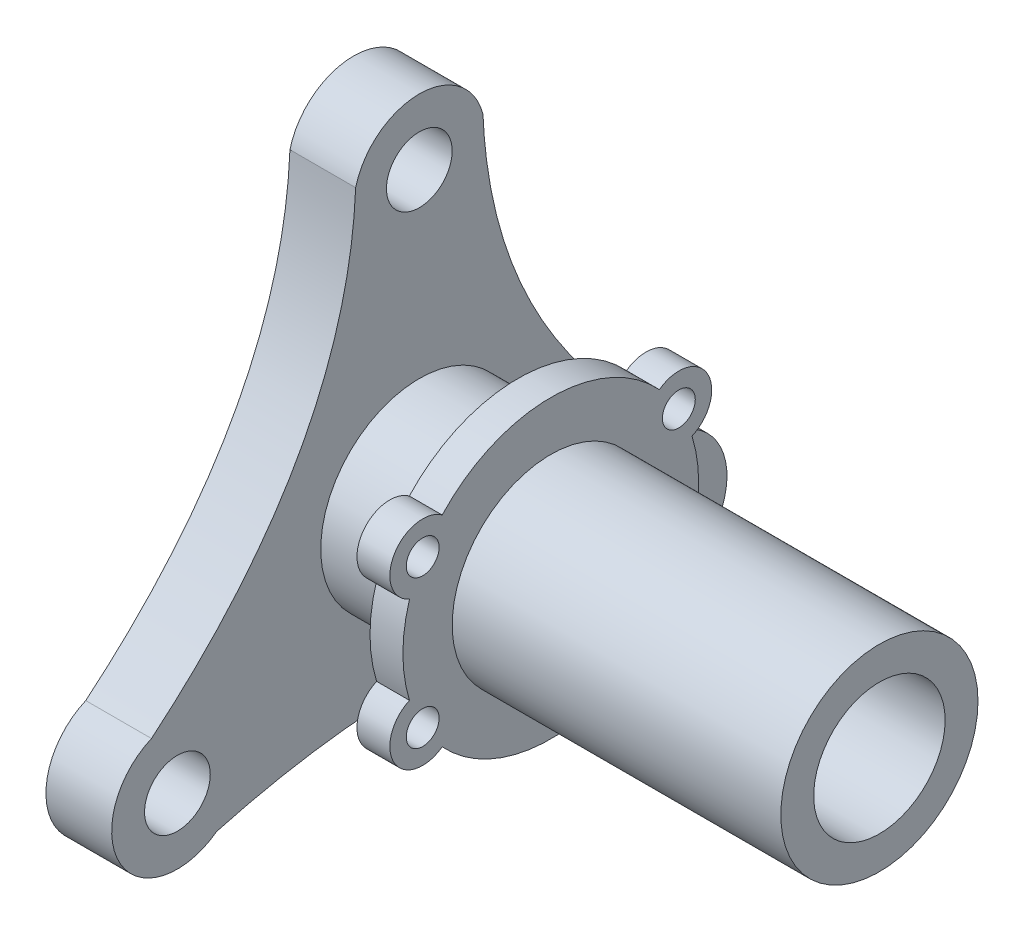
ISO-10303-21;
HEADER;
FILE_DESCRIPTION(('STEP AP214'),'2;1');
FILE_NAME('part.step','',(''),(''),'','','');
FILE_SCHEMA(('AUTOMOTIVE_DESIGN { 1 0 10303 214 1 1 1 1 }'));
ENDSEC;
DATA;
#1=APPLICATION_CONTEXT('core data for automotive mechanical design processes');
#2=APPLICATION_PROTOCOL_DEFINITION('international standard','automotive_design',2000,#1);
#3=PRODUCT_CONTEXT('',#1,'mechanical');
#4=PRODUCT('Part','Part','',(#3));
#5=PRODUCT_RELATED_PRODUCT_CATEGORY('part','',(#4));
#6=PRODUCT_DEFINITION_FORMATION('','',#4);
#7=PRODUCT_DEFINITION_CONTEXT('part definition',#1,'design');
#8=PRODUCT_DEFINITION('design','',#6,#7);
#9=PRODUCT_DEFINITION_SHAPE('','',#8);
#10=(LENGTH_UNIT() NAMED_UNIT(*) SI_UNIT(.MILLI.,.METRE.));
#11=(NAMED_UNIT(*) PLANE_ANGLE_UNIT() SI_UNIT($,.RADIAN.));
#12=(NAMED_UNIT(*) SI_UNIT($,.STERADIAN.) SOLID_ANGLE_UNIT());
#13=UNCERTAINTY_MEASURE_WITH_UNIT(LENGTH_MEASURE(1.E-05),#10,'distance_accuracy_value','');
#14=(GEOMETRIC_REPRESENTATION_CONTEXT(3) GLOBAL_UNCERTAINTY_ASSIGNED_CONTEXT((#13)) GLOBAL_UNIT_ASSIGNED_CONTEXT((#10,
#11,#12)) REPRESENTATION_CONTEXT('',''));
#15=CARTESIAN_POINT('',(0.,0.,0.));
#16=DIRECTION('',(0.,0.,1.));
#17=DIRECTION('',(1.,0.,0.));
#18=AXIS2_PLACEMENT_3D('',#15,#16,#17);
#19=CARTESIAN_POINT('',(30.,0.,0.));
#20=DIRECTION('',(1.,0.,0.));
#21=DIRECTION('',(0.,0.,-1.));
#22=AXIS2_PLACEMENT_3D('',#19,#20,#21);
#23=PLANE('',#22);
#24=CARTESIAN_POINT('',(30.,0.,0.));
#25=DIRECTION('',(1.,0.,0.));
#26=DIRECTION('',(0.,0.,-1.));
#27=AXIS2_PLACEMENT_3D('',#24,#25,#26);
#28=CIRCLE('',#27,22.5);
#29=CARTESIAN_POINT('',(30.,6.66890739310312,21.4889663358249));
#30=VERTEX_POINT('',#29);
#31=CARTESIAN_POINT('',(30.,-6.66890739310267,21.488966335825));
#32=VERTEX_POINT('',#31);
#33=EDGE_CURVE('E233',#30,#32,#28,.T.);
#34=ORIENTED_EDGE('',*,*,#33,.T.);
#35=CARTESIAN_POINT('',(30.,-11.2499999999998,19.48557158515));
#36=DIRECTION('',(1.,0.,0.));
#37=DIRECTION('',(0.,0.,-1.));
#38=AXIS2_PLACEMENT_3D('',#35,#36,#37);
#39=CIRCLE('',#38,5.);
#40=CARTESIAN_POINT('',(30.,-15.2755370513414,16.5199263858256));
#41=VERTEX_POINT('',#40);
#42=EDGE_CURVE('E230',#32,#41,#39,.T.);
#43=ORIENTED_EDGE('',*,*,#42,.T.);
#44=CARTESIAN_POINT('',(30.,0.,0.));
#45=DIRECTION('',(1.,0.,0.));
#46=DIRECTION('',(0.,0.,-1.));
#47=AXIS2_PLACEMENT_3D('',#44,#45,#46);
#48=CIRCLE('',#47,22.5);
#49=CARTESIAN_POINT('',(30.,-15.2755370513417,-16.5199263858253));
#50=VERTEX_POINT('',#49);
#51=EDGE_CURVE('E227',#41,#50,#48,.T.);
#52=ORIENTED_EDGE('',*,*,#51,.T.);
#53=CARTESIAN_POINT('',(30.,-11.2500000000001,-19.4855715851498));
#54=DIRECTION('',(1.,0.,0.));
#55=DIRECTION('',(0.,0.,-1.));
#56=AXIS2_PLACEMENT_3D('',#53,#54,#55);
#57=CIRCLE('',#56,5.00000000000002);
#58=CARTESIAN_POINT('',(30.,-6.66890739310296,-21.4889663358249));
#59=VERTEX_POINT('',#58);
#60=EDGE_CURVE('E224',#50,#59,#57,.T.);
#61=ORIENTED_EDGE('',*,*,#60,.T.);
#62=CARTESIAN_POINT('',(30.,0.,0.));
#63=DIRECTION('',(1.,0.,0.));
#64=DIRECTION('',(0.,0.,-1.));
#65=AXIS2_PLACEMENT_3D('',#62,#63,#64);
#66=CIRCLE('',#65,22.5);
#67=CARTESIAN_POINT('',(30.,6.66890739310282,-21.488966335825));
#68=VERTEX_POINT('',#67);
#69=EDGE_CURVE('E221',#59,#68,#66,.T.);
#70=ORIENTED_EDGE('',*,*,#69,.T.);
#71=CARTESIAN_POINT('',(30.,11.25,-19.4855715851499));
#72=DIRECTION('',(1.,0.,0.));
#73=DIRECTION('',(0.,0.,-1.));
#74=AXIS2_PLACEMENT_3D('',#71,#72,#73);
#75=CIRCLE('',#74,5.);
#76=CARTESIAN_POINT('',(30.,15.2755370513415,-16.5199263858255));
#77=VERTEX_POINT('',#76);
#78=EDGE_CURVE('E218',#68,#77,#75,.T.);
#79=ORIENTED_EDGE('',*,*,#78,.T.);
#80=CARTESIAN_POINT('',(30.,0.,0.));
#81=DIRECTION('',(1.,0.,0.));
#82=DIRECTION('',(0.,0.,-1.));
#83=AXIS2_PLACEMENT_3D('',#80,#81,#82);
#84=CIRCLE('',#83,22.5);
#85=CARTESIAN_POINT('',(30.,15.2755370513418,16.5199263858252));
#86=VERTEX_POINT('',#85);
#87=EDGE_CURVE('E215',#77,#86,#84,.T.);
#88=ORIENTED_EDGE('',*,*,#87,.T.);
#89=CARTESIAN_POINT('',(30.,11.2500000000002,19.4855715851497));
#90=DIRECTION('',(1.,0.,0.));
#91=DIRECTION('',(0.,0.,-1.));
#92=AXIS2_PLACEMENT_3D('',#89,#90,#91);
#93=CIRCLE('',#92,5.);
#94=EDGE_CURVE('E211',#86,#30,#93,.T.);
#95=ORIENTED_EDGE('',*,*,#94,.T.);
#96=EDGE_LOOP('',(#34,#43,#52,#61,#70,#79,#88,#95));
#97=FACE_BOUND('',#96,.T.);
#98=CARTESIAN_POINT('',(30.,11.25,-19.4855715851499));
#99=DIRECTION('',(1.,0.,0.));
#100=DIRECTION('',(0.,0.,-1.));
#101=AXIS2_PLACEMENT_3D('',#98,#99,#100);
#102=CIRCLE('',#101,2.5);
#103=CARTESIAN_POINT('',(30.,11.25,-21.9855715851499));
#104=VERTEX_POINT('',#103);
#105=EDGE_CURVE('E259',#104,#104,#102,.T.);
#106=ORIENTED_EDGE('',*,*,#105,.F.);
#107=EDGE_LOOP('',(#106));
#108=FACE_BOUND('',#107,.T.);
#109=CARTESIAN_POINT('',(30.,-11.2500000000001,-19.4855715851498));
#110=DIRECTION('',(1.,0.,0.));
#111=DIRECTION('',(0.,0.,-1.));
#112=AXIS2_PLACEMENT_3D('',#109,#110,#111);
#113=CIRCLE('',#112,2.5);
#114=CARTESIAN_POINT('',(30.,-11.2500000000001,-21.9855715851498));
#115=VERTEX_POINT('',#114);
#116=EDGE_CURVE('E265',#115,#115,#113,.T.);
#117=ORIENTED_EDGE('',*,*,#116,.F.);
#118=EDGE_LOOP('',(#117));
#119=FACE_BOUND('',#118,.T.);
#120=CARTESIAN_POINT('',(30.,-11.2499999999998,19.48557158515));
#121=DIRECTION('',(1.,0.,0.));
#122=DIRECTION('',(0.,0.,-1.));
#123=AXIS2_PLACEMENT_3D('',#120,#121,#122);
#124=CIRCLE('',#123,2.5);
#125=CARTESIAN_POINT('',(30.,-11.2499999999998,16.98557158515));
#126=VERTEX_POINT('',#125);
#127=EDGE_CURVE('E271',#126,#126,#124,.T.);
#128=ORIENTED_EDGE('',*,*,#127,.F.);
#129=EDGE_LOOP('',(#128));
#130=FACE_BOUND('',#129,.T.);
#131=CARTESIAN_POINT('',(30.,11.2500000000002,19.4855715851497));
#132=DIRECTION('',(1.,0.,0.));
#133=DIRECTION('',(0.,0.,-1.));
#134=AXIS2_PLACEMENT_3D('',#131,#132,#133);
#135=CIRCLE('',#134,2.5);
#136=CARTESIAN_POINT('',(30.,11.2500000000002,16.9855715851497));
#137=VERTEX_POINT('',#136);
#138=EDGE_CURVE('E277',#137,#137,#135,.T.);
#139=ORIENTED_EDGE('',*,*,#138,.F.);
#140=EDGE_LOOP('',(#139));
#141=FACE_BOUND('',#140,.T.);
#142=CARTESIAN_POINT('',(30.,0.,0.));
#143=DIRECTION('',(1.,0.,0.));
#144=DIRECTION('',(0.,0.,-1.));
#145=AXIS2_PLACEMENT_3D('',#142,#143,#144);
#146=CIRCLE('',#145,15.);
#147=CARTESIAN_POINT('',(30.,0.,-15.));
#148=VERTEX_POINT('',#147);
#149=EDGE_CURVE('E283',#148,#148,#146,.T.);
#150=ORIENTED_EDGE('',*,*,#149,.F.);
#151=EDGE_LOOP('',(#150));
#152=FACE_BOUND('',#151,.T.);
#153=ADVANCED_FACE('F36',(#97,#108,#119,#130,#141,#152),#23,.T.);
#154=CARTESIAN_POINT('',(30.,0.,0.));
#155=DIRECTION('',(-1.,0.,0.));
#156=DIRECTION('',(0.,0.,1.));
#157=AXIS2_PLACEMENT_3D('',#154,#155,#156);
#158=CYLINDRICAL_SURFACE('',#157,15.);
#159=CARTESIAN_POINT('',(10.,0.,0.));
#160=DIRECTION('',(1.,0.,0.));
#161=DIRECTION('',(0.,0.,-1.));
#162=AXIS2_PLACEMENT_3D('',#159,#160,#161);
#163=CIRCLE('',#162,15.);
#164=CARTESIAN_POINT('',(10.,0.,-15.));
#165=VERTEX_POINT('',#164);
#166=EDGE_CURVE('E181',#165,#165,#163,.T.);
#167=ORIENTED_EDGE('',*,*,#166,.T.);
#168=EDGE_LOOP('',(#167));
#169=FACE_BOUND('',#168,.T.);
#170=CARTESIAN_POINT('',(25.,0.,0.));
#171=DIRECTION('',(1.,0.,0.));
#172=DIRECTION('',(0.,0.,-1.));
#173=AXIS2_PLACEMENT_3D('',#170,#171,#172);
#174=CIRCLE('',#173,15.);
#175=CARTESIAN_POINT('',(25.,0.,-15.));
#176=VERTEX_POINT('',#175);
#177=EDGE_CURVE('E11',#176,#176,#174,.T.);
#178=ORIENTED_EDGE('',*,*,#177,.F.);
#179=EDGE_LOOP('',(#178));
#180=FACE_BOUND('',#179,.T.);
#181=ADVANCED_FACE('F310',(#169,#180),#158,.T.);
#182=CARTESIAN_POINT('',(10.,-24.8538971723926,-0.713074632202129));
#183=DIRECTION('',(1.,0.,0.));
#184=DIRECTION('',(0.,0.,-1.));
#185=AXIS2_PLACEMENT_3D('',#182,#183,#184);
#186=PLANE('',#185);
#187=CARTESIAN_POINT('',(10.,-21.250000000001,36.8060796608383));
#188=DIRECTION('',(1.,0.,0.));
#189=DIRECTION('',(0.,0.,-1.));
#190=AXIS2_PLACEMENT_3D('',#187,#188,#189);
#191=CIRCLE('',#190,5.00000000000129);
#192=CARTESIAN_POINT('',(10.,-21.250000000001,31.8060796608371));
#193=VERTEX_POINT('',#192);
#194=EDGE_CURVE('E175',#193,#193,#191,.T.);
#195=ORIENTED_EDGE('',*,*,#194,.F.);
#196=EDGE_LOOP('',(#195));
#197=FACE_BOUND('',#196,.T.);
#198=CARTESIAN_POINT('',(10.,42.5,0.));
#199=DIRECTION('',(1.,0.,0.));
#200=DIRECTION('',(0.,0.,-1.));
#201=AXIS2_PLACEMENT_3D('',#198,#199,#200);
#202=CIRCLE('',#201,5.);
#203=CARTESIAN_POINT('',(10.,42.5,-5.));
#204=VERTEX_POINT('',#203);
#205=EDGE_CURVE('E165',#204,#204,#202,.T.);
#206=ORIENTED_EDGE('',*,*,#205,.F.);
#207=EDGE_LOOP('',(#206));
#208=FACE_BOUND('',#207,.T.);
#209=CARTESIAN_POINT('',(10.,-29.2618768078408,30.8219481435671));
#210=CARTESIAN_POINT('',(10.,-20.4459175018926,-1.42614921747392));
#211=CARTESIAN_POINT('',(10.,-29.2618768779443,-30.8219482374278));
#212=B_SPLINE_CURVE_WITH_KNOTS('',2,(#209,#210,#211),.UNSPECIFIED.,.F.,.F.,(3,3),(0.,
0.907199698228636),.UNSPECIFIED.);
#213=CARTESIAN_POINT('',(10.,-29.2618768078408,30.8219481435671));
#214=VERTEX_POINT('',#213);
#215=CARTESIAN_POINT('',(10.,-29.2618768779443,-30.8219482374278));
#216=VERTEX_POINT('',#215);
#217=EDGE_CURVE('E153',#214,#216,#212,.T.);
#218=ORIENTED_EDGE('',*,*,#217,.T.);
#219=CARTESIAN_POINT('',(10.,-21.2500000000002,-36.8060796608397));
#220=DIRECTION('',(1.,0.,0.));
#221=DIRECTION('',(0.,0.,-1.));
#222=AXIS2_PLACEMENT_3D('',#219,#220,#221);
#223=CIRCLE('',#222,10.);
#224=CARTESIAN_POINT('',(10.,-12.0616519353287,-40.7525033383542));
#225=VERTEX_POINT('',#224);
#226=EDGE_CURVE('E93',#216,#225,#223,.T.);
#227=ORIENTED_EDGE('',*,*,#226,.T.);
#228=CARTESIAN_POINT('',(10.,-12.0616519353287,-40.7525033383542));
#229=CARTESIAN_POINT('',(10.,12.1620829710136,-11.0723133540188));
#230=CARTESIAN_POINT('',(10.,44.9908146642047,-9.6848253628335));
#231=B_SPLINE_CURVE_WITH_KNOTS('',2,(#228,#229,#230),.UNSPECIFIED.,.F.,.F.,(3,3),(0.,1.),.UNSPECIFIED.);
#232=CARTESIAN_POINT('',(10.,44.9908146642047,-9.6848253628335));
#233=VERTEX_POINT('',#232);
#234=EDGE_CURVE('E110',#225,#233,#231,.T.);
#235=ORIENTED_EDGE('',*,*,#234,.T.);
#236=CARTESIAN_POINT('',(10.,42.5,0.));
#237=DIRECTION('',(1.,0.,0.));
#238=DIRECTION('',(0.,0.,-1.));
#239=AXIS2_PLACEMENT_3D('',#236,#237,#238);
#240=CIRCLE('',#239,10.);
#241=CARTESIAN_POINT('',(10.,44.9908148190272,9.6848253230151));
#242=VERTEX_POINT('',#241);
#243=EDGE_CURVE('E103',#233,#242,#240,.T.);
#244=ORIENTED_EDGE('',*,*,#243,.T.);
#245=CARTESIAN_POINT('',(10.,44.9908148190272,9.6848253230151));
#246=CARTESIAN_POINT('',(10.,23.4380677165978,10.5790059041494));
#247=CARTESIAN_POINT('',(10.,4.42058607926437,20.9349051381006));
#248=CARTESIAN_POINT('',(10.,-12.0616520474522,40.7525035994051));
#249=B_SPLINE_CURVE_WITH_KNOTS('',3,(#245,#246,#247,#248),.UNSPECIFIED.,.F.,.F.,(4,4),(0.,
0.868352024923659),.UNSPECIFIED.);
#250=CARTESIAN_POINT('',(10.,-12.0616520474522,40.7525035994051));
#251=VERTEX_POINT('',#250);
#252=EDGE_CURVE('E108',#242,#251,#249,.T.);
#253=ORIENTED_EDGE('',*,*,#252,.T.);
#254=CARTESIAN_POINT('',(10.,-21.250000000001,36.8060796608383));
#255=DIRECTION('',(1.,0.,0.));
#256=DIRECTION('',(0.,0.,-1.));
#257=AXIS2_PLACEMENT_3D('',#254,#255,#256);
#258=CIRCLE('',#257,10.);
#259=EDGE_CURVE('E54',#251,#214,#258,.T.);
#260=ORIENTED_EDGE('',*,*,#259,.T.);
#261=EDGE_LOOP('',(#218,#227,#235,#244,#253,#260));
#262=FACE_BOUND('',#261,.T.);
#263=CARTESIAN_POINT('',(10.,-21.2500000000002,-36.8060796608397));
#264=DIRECTION('',(1.,0.,0.));
#265=DIRECTION('',(0.,0.,-1.));
#266=AXIS2_PLACEMENT_3D('',#263,#264,#265);
#267=CIRCLE('',#266,5.00000000000018);
#268=CARTESIAN_POINT('',(10.,-21.2500000000002,-41.8060796608398));
#269=VERTEX_POINT('',#268);
#270=EDGE_CURVE('E169',#269,#269,#267,.T.);
#271=ORIENTED_EDGE('',*,*,#270,.F.);
#272=EDGE_LOOP('',(#271));
#273=FACE_BOUND('',#272,.T.);
#274=ORIENTED_EDGE('',*,*,#166,.F.);
#275=EDGE_LOOP('',(#274));
#276=FACE_BOUND('',#275,.T.);
#277=ADVANCED_FACE('F105',(#197,#208,#262,#273,#276),#186,.T.);
#278=CARTESIAN_POINT('',(0.,-24.8538971723926,-0.713074632202129));
#279=DIRECTION('',(1.,0.,0.));
#280=DIRECTION('',(0.,0.,-1.));
#281=AXIS2_PLACEMENT_3D('',#278,#279,#280);
#282=PLANE('',#281);
#283=CARTESIAN_POINT('',(0.,-29.2618768078408,30.8219481435671));
#284=CARTESIAN_POINT('',(0.,-20.4459175018926,-1.42614921747392));
#285=CARTESIAN_POINT('',(0.,-29.2618768779443,-30.8219482374278));
#286=B_SPLINE_CURVE_WITH_KNOTS('',2,(#283,#284,#285),.UNSPECIFIED.,.F.,.F.,(3,3),(0.,
0.907199698228636),.UNSPECIFIED.);
#287=CARTESIAN_POINT('',(0.,-29.2618768078408,30.8219481435671));
#288=VERTEX_POINT('',#287);
#289=CARTESIAN_POINT('',(0.,-29.2618768779443,-30.8219482374278));
#290=VERTEX_POINT('',#289);
#291=EDGE_CURVE('E164',#288,#290,#286,.T.);
#292=ORIENTED_EDGE('',*,*,#291,.F.);
#293=CARTESIAN_POINT('',(0.,-21.250000000001,36.8060796608383));
#294=DIRECTION('',(1.,0.,0.));
#295=DIRECTION('',(0.,0.,-1.));
#296=AXIS2_PLACEMENT_3D('',#293,#294,#295);
#297=CIRCLE('',#296,10.);
#298=CARTESIAN_POINT('',(0.,-12.0616520474522,40.7525035994051));
#299=VERTEX_POINT('',#298);
#300=EDGE_CURVE('E84',#299,#288,#297,.T.);
#301=ORIENTED_EDGE('',*,*,#300,.F.);
#302=CARTESIAN_POINT('',(0.,44.9908148190272,9.6848253230151));
#303=CARTESIAN_POINT('',(0.,23.4380677165978,10.5790059041494));
#304=CARTESIAN_POINT('',(0.,4.42058607926437,20.9349051381006));
#305=CARTESIAN_POINT('',(0.,-12.0616520474522,40.7525035994051));
#306=B_SPLINE_CURVE_WITH_KNOTS('',3,(#302,#303,#304,#305),.UNSPECIFIED.,.F.,.F.,(4,4),(0.,
0.868352024923659),.UNSPECIFIED.);
#307=CARTESIAN_POINT('',(0.,44.9908148190272,9.6848253230151));
#308=VERTEX_POINT('',#307);
#309=EDGE_CURVE('E78',#308,#299,#306,.T.);
#310=ORIENTED_EDGE('',*,*,#309,.F.);
#311=CARTESIAN_POINT('',(0.,42.5,0.));
#312=DIRECTION('',(1.,0.,0.));
#313=DIRECTION('',(0.,0.,-1.));
#314=AXIS2_PLACEMENT_3D('',#311,#312,#313);
#315=CIRCLE('',#314,10.);
#316=CARTESIAN_POINT('',(0.,44.9908146642047,-9.6848253628335));
#317=VERTEX_POINT('',#316);
#318=EDGE_CURVE('E118',#317,#308,#315,.T.);
#319=ORIENTED_EDGE('',*,*,#318,.F.);
#320=CARTESIAN_POINT('',(0.,-12.0616519353287,-40.7525033383542));
#321=CARTESIAN_POINT('',(0.,12.1620829710136,-11.0723133540188));
#322=CARTESIAN_POINT('',(0.,44.9908146642047,-9.6848253628335));
#323=B_SPLINE_CURVE_WITH_KNOTS('',2,(#320,#321,#322),.UNSPECIFIED.,.F.,.F.,(3,3),(0.,1.),.UNSPECIFIED.);
#324=CARTESIAN_POINT('',(0.,-12.0616519353287,-40.7525033383542));
#325=VERTEX_POINT('',#324);
#326=EDGE_CURVE('E363',#325,#317,#323,.T.);
#327=ORIENTED_EDGE('',*,*,#326,.F.);
#328=CARTESIAN_POINT('',(0.,-21.2500000000002,-36.8060796608397));
#329=DIRECTION('',(1.,0.,0.));
#330=DIRECTION('',(0.,0.,-1.));
#331=AXIS2_PLACEMENT_3D('',#328,#329,#330);
#332=CIRCLE('',#331,10.);
#333=EDGE_CURVE('E361',#290,#325,#332,.T.);
#334=ORIENTED_EDGE('',*,*,#333,.F.);
#335=EDGE_LOOP('',(#292,#301,#310,#319,#327,#334));
#336=FACE_BOUND('',#335,.T.);
#337=CARTESIAN_POINT('',(0.,0.,0.));
#338=DIRECTION('',(1.,0.,0.));
#339=DIRECTION('',(0.,0.,-1.));
#340=AXIS2_PLACEMENT_3D('',#337,#338,#339);
#341=CIRCLE('',#340,10.);
#342=CARTESIAN_POINT('',(0.,0.,-10.));
#343=VERTEX_POINT('',#342);
#344=EDGE_CURVE('E158',#343,#343,#341,.T.);
#345=ORIENTED_EDGE('',*,*,#344,.T.);
#346=EDGE_LOOP('',(#345));
#347=FACE_BOUND('',#346,.T.);
#348=CARTESIAN_POINT('',(0.,42.5,0.));
#349=DIRECTION('',(1.,0.,0.));
#350=DIRECTION('',(0.,0.,-1.));
#351=AXIS2_PLACEMENT_3D('',#348,#349,#350);
#352=CIRCLE('',#351,5.);
#353=CARTESIAN_POINT('',(0.,42.5,-5.));
#354=VERTEX_POINT('',#353);
#355=EDGE_CURVE('E166',#354,#354,#352,.T.);
#356=ORIENTED_EDGE('',*,*,#355,.T.);
#357=EDGE_LOOP('',(#356));
#358=FACE_BOUND('',#357,.T.);
#359=CARTESIAN_POINT('',(0.,-21.2500000000002,-36.8060796608397));
#360=DIRECTION('',(1.,0.,0.));
#361=DIRECTION('',(0.,0.,-1.));
#362=AXIS2_PLACEMENT_3D('',#359,#360,#361);
#363=CIRCLE('',#362,5.00000000000018);
#364=CARTESIAN_POINT('',(0.,-21.2500000000002,-41.8060796608398));
#365=VERTEX_POINT('',#364);
#366=EDGE_CURVE('E172',#365,#365,#363,.T.);
#367=ORIENTED_EDGE('',*,*,#366,.T.);
#368=EDGE_LOOP('',(#367));
#369=FACE_BOUND('',#368,.T.);
#370=CARTESIAN_POINT('',(0.,-21.250000000001,36.8060796608383));
#371=DIRECTION('',(1.,0.,0.));
#372=DIRECTION('',(0.,0.,-1.));
#373=AXIS2_PLACEMENT_3D('',#370,#371,#372);
#374=CIRCLE('',#373,5.00000000000129);
#375=CARTESIAN_POINT('',(0.,-21.250000000001,31.8060796608371));
#376=VERTEX_POINT('',#375);
#377=EDGE_CURVE('E178',#376,#376,#374,.T.);
#378=ORIENTED_EDGE('',*,*,#377,.T.);
#379=EDGE_LOOP('',(#378));
#380=FACE_BOUND('',#379,.T.);
#381=ADVANCED_FACE('F339',(#336,#347,#358,#369,#380),#282,.F.);
#382=DIRECTION('',(-1.,0.,0.));
#383=VECTOR('',#382,1.);
#384=SURFACE_OF_LINEAR_EXTRUSION('',#212,#383);
#385=ORIENTED_EDGE('',*,*,#291,.T.);
#386=DIRECTION('',(-1.,0.,0.));
#387=VECTOR('',#386,1.);
#388=CARTESIAN_POINT('',(10.,-29.2618768779443,-30.8219482374278));
#389=LINE('',#388,#387);
#390=EDGE_CURVE('E46',#216,#290,#389,.T.);
#391=ORIENTED_EDGE('',*,*,#390,.F.);
#392=ORIENTED_EDGE('',*,*,#217,.F.);
#393=DIRECTION('',(-1.,0.,0.));
#394=VECTOR('',#393,1.);
#395=CARTESIAN_POINT('',(10.,-29.2618768078408,30.8219481435671));
#396=LINE('',#395,#394);
#397=EDGE_CURVE('E124',#214,#288,#396,.T.);
#398=ORIENTED_EDGE('',*,*,#397,.T.);
#399=EDGE_LOOP('',(#385,#391,#392,#398));
#400=FACE_BOUND('',#399,.T.);
#401=ADVANCED_FACE('F38',(#400),#384,.F.);
#402=CARTESIAN_POINT('',(10.,-21.2500000000002,-36.8060796608397));
#403=DIRECTION('',(-1.,0.,0.));
#404=DIRECTION('',(0.,0.,1.));
#405=AXIS2_PLACEMENT_3D('',#402,#403,#404);
#406=CYLINDRICAL_SURFACE('',#405,10.);
#407=ORIENTED_EDGE('',*,*,#333,.T.);
#408=DIRECTION('',(-1.,0.,0.));
#409=VECTOR('',#408,1.);
#410=CARTESIAN_POINT('',(10.,-12.0616519353287,-40.7525033383542));
#411=LINE('',#410,#409);
#412=EDGE_CURVE('E388',#225,#325,#411,.T.);
#413=ORIENTED_EDGE('',*,*,#412,.F.);
#414=ORIENTED_EDGE('',*,*,#226,.F.);
#415=ORIENTED_EDGE('',*,*,#390,.T.);
#416=EDGE_LOOP('',(#407,#413,#414,#415));
#417=FACE_BOUND('',#416,.T.);
#418=ADVANCED_FACE('F144',(#417),#406,.T.);
#419=DIRECTION('',(-1.,0.,0.));
#420=VECTOR('',#419,1.);
#421=SURFACE_OF_LINEAR_EXTRUSION('',#231,#420);
#422=ORIENTED_EDGE('',*,*,#326,.T.);
#423=DIRECTION('',(-1.,0.,0.));
#424=VECTOR('',#423,1.);
#425=CARTESIAN_POINT('',(10.,44.9908146642047,-9.6848253628335));
#426=LINE('',#425,#424);
#427=EDGE_CURVE('E119',#233,#317,#426,.T.);
#428=ORIENTED_EDGE('',*,*,#427,.F.);
#429=ORIENTED_EDGE('',*,*,#234,.F.);
#430=ORIENTED_EDGE('',*,*,#412,.T.);
#431=EDGE_LOOP('',(#422,#428,#429,#430));
#432=FACE_BOUND('',#431,.T.);
#433=ADVANCED_FACE('F142',(#432),#421,.F.);
#434=CARTESIAN_POINT('',(10.,42.5,0.));
#435=DIRECTION('',(-1.,0.,0.));
#436=DIRECTION('',(0.,0.,1.));
#437=AXIS2_PLACEMENT_3D('',#434,#435,#436);
#438=CYLINDRICAL_SURFACE('',#437,10.);
#439=ORIENTED_EDGE('',*,*,#318,.T.);
#440=DIRECTION('',(-1.,0.,0.));
#441=VECTOR('',#440,1.);
#442=CARTESIAN_POINT('',(10.,44.9908148190272,9.6848253230151));
#443=LINE('',#442,#441);
#444=EDGE_CURVE('E115',#242,#308,#443,.T.);
#445=ORIENTED_EDGE('',*,*,#444,.F.);
#446=ORIENTED_EDGE('',*,*,#243,.F.);
#447=ORIENTED_EDGE('',*,*,#427,.T.);
#448=EDGE_LOOP('',(#439,#445,#446,#447));
#449=FACE_BOUND('',#448,.T.);
#450=ADVANCED_FACE('F116',(#449),#438,.T.);
#451=DIRECTION('',(-1.,0.,0.));
#452=VECTOR('',#451,1.);
#453=SURFACE_OF_LINEAR_EXTRUSION('',#249,#452);
#454=ORIENTED_EDGE('',*,*,#309,.T.);
#455=DIRECTION('',(-1.,0.,0.));
#456=VECTOR('',#455,1.);
#457=CARTESIAN_POINT('',(10.,-12.0616520474522,40.7525035994051));
#458=LINE('',#457,#456);
#459=EDGE_CURVE('E120',#251,#299,#458,.T.);
#460=ORIENTED_EDGE('',*,*,#459,.F.);
#461=ORIENTED_EDGE('',*,*,#252,.F.);
#462=ORIENTED_EDGE('',*,*,#444,.T.);
#463=EDGE_LOOP('',(#454,#460,#461,#462));
#464=FACE_BOUND('',#463,.T.);
#465=ADVANCED_FACE('F122',(#464),#453,.F.);
#466=CARTESIAN_POINT('',(10.,-21.250000000001,36.8060796608383));
#467=DIRECTION('',(-1.,0.,0.));
#468=DIRECTION('',(0.,0.,1.));
#469=AXIS2_PLACEMENT_3D('',#466,#467,#468);
#470=CYLINDRICAL_SURFACE('',#469,10.);
#471=ORIENTED_EDGE('',*,*,#300,.T.);
#472=ORIENTED_EDGE('',*,*,#397,.F.);
#473=ORIENTED_EDGE('',*,*,#259,.F.);
#474=ORIENTED_EDGE('',*,*,#459,.T.);
#475=EDGE_LOOP('',(#471,#472,#473,#474));
#476=FACE_BOUND('',#475,.T.);
#477=ADVANCED_FACE('F138',(#476),#470,.T.);
#478=CARTESIAN_POINT('',(10.,0.,0.));
#479=DIRECTION('',(-1.,0.,0.));
#480=DIRECTION('',(0.,0.,1.));
#481=AXIS2_PLACEMENT_3D('',#478,#479,#480);
#482=CYLINDRICAL_SURFACE('',#481,10.);
#483=ORIENTED_EDGE('',*,*,#344,.F.);
#484=EDGE_LOOP('',(#483));
#485=FACE_BOUND('',#484,.T.);
#486=CARTESIAN_POINT('',(80.,0.,0.));
#487=DIRECTION('',(1.,0.,0.));
#488=DIRECTION('',(0.,0.,-1.));
#489=AXIS2_PLACEMENT_3D('',#486,#487,#488);
#490=CIRCLE('',#489,10.);
#491=CARTESIAN_POINT('',(80.,0.,-10.));
#492=VERTEX_POINT('',#491);
#493=EDGE_CURVE('E286',#492,#492,#490,.T.);
#494=ORIENTED_EDGE('',*,*,#493,.T.);
#495=EDGE_LOOP('',(#494));
#496=FACE_BOUND('',#495,.T.);
#497=ADVANCED_FACE('F292',(#485,#496),#482,.F.);
#498=CARTESIAN_POINT('',(10.,42.5,0.));
#499=DIRECTION('',(-1.,0.,0.));
#500=DIRECTION('',(0.,0.,1.));
#501=AXIS2_PLACEMENT_3D('',#498,#499,#500);
#502=CYLINDRICAL_SURFACE('',#501,5.);
#503=ORIENTED_EDGE('',*,*,#205,.T.);
#504=EDGE_LOOP('',(#503));
#505=FACE_BOUND('',#504,.T.);
#506=ORIENTED_EDGE('',*,*,#355,.F.);
#507=EDGE_LOOP('',(#506));
#508=FACE_BOUND('',#507,.T.);
#509=ADVANCED_FACE('F330',(#505,#508),#502,.F.);
#510=CARTESIAN_POINT('',(10.,-21.2500000000002,-36.8060796608397));
#511=DIRECTION('',(-1.,0.,0.));
#512=DIRECTION('',(0.,0.,1.));
#513=AXIS2_PLACEMENT_3D('',#510,#511,#512);
#514=CYLINDRICAL_SURFACE('',#513,5.00000000000018);
#515=ORIENTED_EDGE('',*,*,#270,.T.);
#516=EDGE_LOOP('',(#515));
#517=FACE_BOUND('',#516,.T.);
#518=ORIENTED_EDGE('',*,*,#366,.F.);
#519=EDGE_LOOP('',(#518));
#520=FACE_BOUND('',#519,.T.);
#521=ADVANCED_FACE('F326',(#517,#520),#514,.F.);
#522=CARTESIAN_POINT('',(10.,-21.250000000001,36.8060796608383));
#523=DIRECTION('',(-1.,0.,0.));
#524=DIRECTION('',(0.,0.,1.));
#525=AXIS2_PLACEMENT_3D('',#522,#523,#524);
#526=CYLINDRICAL_SURFACE('',#525,5.00000000000129);
#527=ORIENTED_EDGE('',*,*,#194,.T.);
#528=EDGE_LOOP('',(#527));
#529=FACE_BOUND('',#528,.T.);
#530=ORIENTED_EDGE('',*,*,#377,.F.);
#531=EDGE_LOOP('',(#530));
#532=FACE_BOUND('',#531,.T.);
#533=ADVANCED_FACE('F323',(#529,#532),#526,.F.);
#534=CARTESIAN_POINT('',(25.,0.,0.));
#535=DIRECTION('',(1.,0.,0.));
#536=DIRECTION('',(0.,0.,-1.));
#537=AXIS2_PLACEMENT_3D('',#534,#535,#536);
#538=CYLINDRICAL_SURFACE('',#537,22.5);
#539=ORIENTED_EDGE('',*,*,#33,.F.);
#540=DIRECTION('',(1.,0.,0.));
#541=VECTOR('',#540,1.);
#542=CARTESIAN_POINT('',(25.,6.66890739310312,21.4889663358249));
#543=LINE('',#542,#541);
#544=CARTESIAN_POINT('',(25.,6.66890739310312,21.4889663358249));
#545=VERTEX_POINT('',#544);
#546=EDGE_CURVE('E186',#545,#30,#543,.T.);
#547=ORIENTED_EDGE('',*,*,#546,.F.);
#548=CARTESIAN_POINT('',(25.,0.,0.));
#549=DIRECTION('',(1.,0.,0.));
#550=DIRECTION('',(0.,0.,-1.));
#551=AXIS2_PLACEMENT_3D('',#548,#549,#550);
#552=CIRCLE('',#551,22.5);
#553=CARTESIAN_POINT('',(25.,-6.66890739310267,21.488966335825));
#554=VERTEX_POINT('',#553);
#555=EDGE_CURVE('E214',#545,#554,#552,.T.);
#556=ORIENTED_EDGE('',*,*,#555,.T.);
#557=DIRECTION('',(1.,0.,0.));
#558=VECTOR('',#557,1.);
#559=CARTESIAN_POINT('',(25.,-6.66890739310267,21.488966335825));
#560=LINE('',#559,#558);
#561=EDGE_CURVE('E187',#554,#32,#560,.T.);
#562=ORIENTED_EDGE('',*,*,#561,.T.);
#563=EDGE_LOOP('',(#539,#547,#556,#562));
#564=FACE_BOUND('',#563,.T.);
#565=ADVANCED_FACE('F320',(#564),#538,.T.);
#566=CARTESIAN_POINT('',(25.,11.2500000000002,19.4855715851497));
#567=DIRECTION('',(1.,0.,0.));
#568=DIRECTION('',(0.,0.,-1.));
#569=AXIS2_PLACEMENT_3D('',#566,#567,#568);
#570=CYLINDRICAL_SURFACE('',#569,5.);
#571=ORIENTED_EDGE('',*,*,#94,.F.);
#572=DIRECTION('',(1.,0.,0.));
#573=VECTOR('',#572,1.);
#574=CARTESIAN_POINT('',(25.,15.2755370513418,16.5199263858252));
#575=LINE('',#574,#573);
#576=CARTESIAN_POINT('',(25.,15.2755370513418,16.5199263858252));
#577=VERTEX_POINT('',#576);
#578=EDGE_CURVE('E206',#577,#86,#575,.T.);
#579=ORIENTED_EDGE('',*,*,#578,.F.);
#580=CARTESIAN_POINT('',(25.,11.2500000000002,19.4855715851497));
#581=DIRECTION('',(1.,0.,0.));
#582=DIRECTION('',(0.,0.,-1.));
#583=AXIS2_PLACEMENT_3D('',#580,#581,#582);
#584=CIRCLE('',#583,5.);
#585=EDGE_CURVE('E191',#577,#545,#584,.T.);
#586=ORIENTED_EDGE('',*,*,#585,.T.);
#587=ORIENTED_EDGE('',*,*,#546,.T.);
#588=EDGE_LOOP('',(#571,#579,#586,#587));
#589=FACE_BOUND('',#588,.T.);
#590=ADVANCED_FACE('F419',(#589),#570,.T.);
#591=CARTESIAN_POINT('',(25.,0.,0.));
#592=DIRECTION('',(1.,0.,0.));
#593=DIRECTION('',(0.,0.,-1.));
#594=AXIS2_PLACEMENT_3D('',#591,#592,#593);
#595=CYLINDRICAL_SURFACE('',#594,22.5);
#596=ORIENTED_EDGE('',*,*,#87,.F.);
#597=DIRECTION('',(1.,0.,0.));
#598=VECTOR('',#597,1.);
#599=CARTESIAN_POINT('',(25.,15.2755370513415,-16.5199263858255));
#600=LINE('',#599,#598);
#601=CARTESIAN_POINT('',(25.,15.2755370513415,-16.5199263858255));
#602=VERTEX_POINT('',#601);
#603=EDGE_CURVE('E203',#602,#77,#600,.T.);
#604=ORIENTED_EDGE('',*,*,#603,.F.);
#605=CARTESIAN_POINT('',(25.,0.,0.));
#606=DIRECTION('',(1.,0.,0.));
#607=DIRECTION('',(0.,0.,-1.));
#608=AXIS2_PLACEMENT_3D('',#605,#606,#607);
#609=CIRCLE('',#608,22.5);
#610=EDGE_CURVE('E239',#602,#577,#609,.T.);
#611=ORIENTED_EDGE('',*,*,#610,.T.);
#612=ORIENTED_EDGE('',*,*,#578,.T.);
#613=EDGE_LOOP('',(#596,#604,#611,#612));
#614=FACE_BOUND('',#613,.T.);
#615=ADVANCED_FACE('F427',(#614),#595,.T.);
#616=CARTESIAN_POINT('',(25.,11.25,-19.4855715851499));
#617=DIRECTION('',(1.,0.,0.));
#618=DIRECTION('',(0.,0.,-1.));
#619=AXIS2_PLACEMENT_3D('',#616,#617,#618);
#620=CYLINDRICAL_SURFACE('',#619,5.);
#621=ORIENTED_EDGE('',*,*,#78,.F.);
#622=DIRECTION('',(1.,0.,0.));
#623=VECTOR('',#622,1.);
#624=CARTESIAN_POINT('',(25.,6.66890739310282,-21.488966335825));
#625=LINE('',#624,#623);
#626=CARTESIAN_POINT('',(25.,6.66890739310282,-21.488966335825));
#627=VERTEX_POINT('',#626);
#628=EDGE_CURVE('E200',#627,#68,#625,.T.);
#629=ORIENTED_EDGE('',*,*,#628,.F.);
#630=CARTESIAN_POINT('',(25.,11.25,-19.4855715851499));
#631=DIRECTION('',(1.,0.,0.));
#632=DIRECTION('',(0.,0.,-1.));
#633=AXIS2_PLACEMENT_3D('',#630,#631,#632);
#634=CIRCLE('',#633,5.);
#635=EDGE_CURVE('E242',#627,#602,#634,.T.);
#636=ORIENTED_EDGE('',*,*,#635,.T.);
#637=ORIENTED_EDGE('',*,*,#603,.T.);
#638=EDGE_LOOP('',(#621,#629,#636,#637));
#639=FACE_BOUND('',#638,.T.);
#640=ADVANCED_FACE('F435',(#639),#620,.T.);
#641=CARTESIAN_POINT('',(25.,0.,0.));
#642=DIRECTION('',(1.,0.,0.));
#643=DIRECTION('',(0.,0.,-1.));
#644=AXIS2_PLACEMENT_3D('',#641,#642,#643);
#645=CYLINDRICAL_SURFACE('',#644,22.5);
#646=ORIENTED_EDGE('',*,*,#69,.F.);
#647=DIRECTION('',(1.,0.,0.));
#648=VECTOR('',#647,1.);
#649=CARTESIAN_POINT('',(25.,-6.66890739310296,-21.4889663358249));
#650=LINE('',#649,#648);
#651=CARTESIAN_POINT('',(25.,-6.66890739310296,-21.4889663358249));
#652=VERTEX_POINT('',#651);
#653=EDGE_CURVE('E197',#652,#59,#650,.T.);
#654=ORIENTED_EDGE('',*,*,#653,.F.);
#655=CARTESIAN_POINT('',(25.,0.,0.));
#656=DIRECTION('',(1.,0.,0.));
#657=DIRECTION('',(0.,0.,-1.));
#658=AXIS2_PLACEMENT_3D('',#655,#656,#657);
#659=CIRCLE('',#658,22.5);
#660=EDGE_CURVE('E245',#652,#627,#659,.T.);
#661=ORIENTED_EDGE('',*,*,#660,.T.);
#662=ORIENTED_EDGE('',*,*,#628,.T.);
#663=EDGE_LOOP('',(#646,#654,#661,#662));
#664=FACE_BOUND('',#663,.T.);
#665=ADVANCED_FACE('F443',(#664),#645,.T.);
#666=CARTESIAN_POINT('',(25.,-11.2500000000001,-19.4855715851498));
#667=DIRECTION('',(1.,0.,0.));
#668=DIRECTION('',(0.,0.,-1.));
#669=AXIS2_PLACEMENT_3D('',#666,#667,#668);
#670=CYLINDRICAL_SURFACE('',#669,5.00000000000002);
#671=ORIENTED_EDGE('',*,*,#60,.F.);
#672=DIRECTION('',(1.,0.,0.));
#673=VECTOR('',#672,1.);
#674=CARTESIAN_POINT('',(25.,-15.2755370513417,-16.5199263858253));
#675=LINE('',#674,#673);
#676=CARTESIAN_POINT('',(25.,-15.2755370513417,-16.5199263858253));
#677=VERTEX_POINT('',#676);
#678=EDGE_CURVE('E194',#677,#50,#675,.T.);
#679=ORIENTED_EDGE('',*,*,#678,.F.);
#680=CARTESIAN_POINT('',(25.,-11.2500000000001,-19.4855715851498));
#681=DIRECTION('',(1.,0.,0.));
#682=DIRECTION('',(0.,0.,-1.));
#683=AXIS2_PLACEMENT_3D('',#680,#681,#682);
#684=CIRCLE('',#683,5.00000000000002);
#685=EDGE_CURVE('E248',#677,#652,#684,.T.);
#686=ORIENTED_EDGE('',*,*,#685,.T.);
#687=ORIENTED_EDGE('',*,*,#653,.T.);
#688=EDGE_LOOP('',(#671,#679,#686,#687));
#689=FACE_BOUND('',#688,.T.);
#690=ADVANCED_FACE('F451',(#689),#670,.T.);
#691=CARTESIAN_POINT('',(25.,0.,0.));
#692=DIRECTION('',(1.,0.,0.));
#693=DIRECTION('',(0.,0.,-1.));
#694=AXIS2_PLACEMENT_3D('',#691,#692,#693);
#695=CYLINDRICAL_SURFACE('',#694,22.5);
#696=ORIENTED_EDGE('',*,*,#51,.F.);
#697=DIRECTION('',(1.,0.,0.));
#698=VECTOR('',#697,1.);
#699=CARTESIAN_POINT('',(25.,-15.2755370513414,16.5199263858256));
#700=LINE('',#699,#698);
#701=CARTESIAN_POINT('',(25.,-15.2755370513414,16.5199263858256));
#702=VERTEX_POINT('',#701);
#703=EDGE_CURVE('E190',#702,#41,#700,.T.);
#704=ORIENTED_EDGE('',*,*,#703,.F.);
#705=CARTESIAN_POINT('',(25.,0.,0.));
#706=DIRECTION('',(1.,0.,0.));
#707=DIRECTION('',(0.,0.,-1.));
#708=AXIS2_PLACEMENT_3D('',#705,#706,#707);
#709=CIRCLE('',#708,22.5);
#710=EDGE_CURVE('E251',#702,#677,#709,.T.);
#711=ORIENTED_EDGE('',*,*,#710,.T.);
#712=ORIENTED_EDGE('',*,*,#678,.T.);
#713=EDGE_LOOP('',(#696,#704,#711,#712));
#714=FACE_BOUND('',#713,.T.);
#715=ADVANCED_FACE('F459',(#714),#695,.T.);
#716=CARTESIAN_POINT('',(25.,-11.2499999999998,19.48557158515));
#717=DIRECTION('',(1.,0.,0.));
#718=DIRECTION('',(0.,0.,-1.));
#719=AXIS2_PLACEMENT_3D('',#716,#717,#718);
#720=CYLINDRICAL_SURFACE('',#719,5.);
#721=ORIENTED_EDGE('',*,*,#42,.F.);
#722=ORIENTED_EDGE('',*,*,#561,.F.);
#723=CARTESIAN_POINT('',(25.,-11.2499999999998,19.48557158515));
#724=DIRECTION('',(1.,0.,0.));
#725=DIRECTION('',(0.,0.,-1.));
#726=AXIS2_PLACEMENT_3D('',#723,#724,#725);
#727=CIRCLE('',#726,5.);
#728=EDGE_CURVE('E254',#554,#702,#727,.T.);
#729=ORIENTED_EDGE('',*,*,#728,.T.);
#730=ORIENTED_EDGE('',*,*,#703,.T.);
#731=EDGE_LOOP('',(#721,#722,#729,#730));
#732=FACE_BOUND('',#731,.T.);
#733=ADVANCED_FACE('F467',(#732),#720,.T.);
#734=CARTESIAN_POINT('',(25.,-5.62499999999991,9.74278579257499));
#735=DIRECTION('',(1.,0.,0.));
#736=DIRECTION('',(0.,0.,-1.));
#737=AXIS2_PLACEMENT_3D('',#734,#735,#736);
#738=PLANE('',#737);
#739=CARTESIAN_POINT('',(25.,11.2500000000002,19.4855715851497));
#740=DIRECTION('',(1.,0.,0.));
#741=DIRECTION('',(0.,0.,-1.));
#742=AXIS2_PLACEMENT_3D('',#739,#740,#741);
#743=CIRCLE('',#742,2.5);
#744=CARTESIAN_POINT('',(25.,11.2500000000002,16.9855715851497));
#745=VERTEX_POINT('',#744);
#746=EDGE_CURVE('E274',#745,#745,#743,.T.);
#747=ORIENTED_EDGE('',*,*,#746,.T.);
#748=EDGE_LOOP('',(#747));
#749=FACE_BOUND('',#748,.T.);
#750=CARTESIAN_POINT('',(25.,-11.2499999999998,19.48557158515));
#751=DIRECTION('',(1.,0.,0.));
#752=DIRECTION('',(0.,0.,-1.));
#753=AXIS2_PLACEMENT_3D('',#750,#751,#752);
#754=CIRCLE('',#753,2.5);
#755=CARTESIAN_POINT('',(25.,-11.2499999999998,16.98557158515));
#756=VERTEX_POINT('',#755);
#757=EDGE_CURVE('E268',#756,#756,#754,.T.);
#758=ORIENTED_EDGE('',*,*,#757,.T.);
#759=EDGE_LOOP('',(#758));
#760=FACE_BOUND('',#759,.T.);
#761=ORIENTED_EDGE('',*,*,#177,.T.);
#762=EDGE_LOOP('',(#761));
#763=FACE_BOUND('',#762,.T.);
#764=CARTESIAN_POINT('',(25.,-11.2500000000001,-19.4855715851498));
#765=DIRECTION('',(1.,0.,0.));
#766=DIRECTION('',(0.,0.,-1.));
#767=AXIS2_PLACEMENT_3D('',#764,#765,#766);
#768=CIRCLE('',#767,2.5);
#769=CARTESIAN_POINT('',(25.,-11.2500000000001,-21.9855715851498));
#770=VERTEX_POINT('',#769);
#771=EDGE_CURVE('E262',#770,#770,#768,.T.);
#772=ORIENTED_EDGE('',*,*,#771,.T.);
#773=EDGE_LOOP('',(#772));
#774=FACE_BOUND('',#773,.T.);
#775=CARTESIAN_POINT('',(25.,11.25,-19.4855715851499));
#776=DIRECTION('',(1.,0.,0.));
#777=DIRECTION('',(0.,0.,-1.));
#778=AXIS2_PLACEMENT_3D('',#775,#776,#777);
#779=CIRCLE('',#778,2.5);
#780=CARTESIAN_POINT('',(25.,11.25,-21.9855715851499));
#781=VERTEX_POINT('',#780);
#782=EDGE_CURVE('E236',#781,#781,#779,.T.);
#783=ORIENTED_EDGE('',*,*,#782,.T.);
#784=EDGE_LOOP('',(#783));
#785=FACE_BOUND('',#784,.T.);
#786=ORIENTED_EDGE('',*,*,#555,.F.);
#787=ORIENTED_EDGE('',*,*,#585,.F.);
#788=ORIENTED_EDGE('',*,*,#610,.F.);
#789=ORIENTED_EDGE('',*,*,#635,.F.);
#790=ORIENTED_EDGE('',*,*,#660,.F.);
#791=ORIENTED_EDGE('',*,*,#685,.F.);
#792=ORIENTED_EDGE('',*,*,#710,.F.);
#793=ORIENTED_EDGE('',*,*,#728,.F.);
#794=EDGE_LOOP('',(#786,#787,#788,#789,#790,#791,#792,#793));
#795=FACE_BOUND('',#794,.T.);
#796=ADVANCED_FACE('F475',(#749,#760,#763,#774,#785,#795),#738,.F.);
#797=CARTESIAN_POINT('',(25.,11.25,-19.4855715851499));
#798=DIRECTION('',(1.,0.,0.));
#799=DIRECTION('',(0.,0.,-1.));
#800=AXIS2_PLACEMENT_3D('',#797,#798,#799);
#801=CYLINDRICAL_SURFACE('',#800,2.5);
#802=ORIENTED_EDGE('',*,*,#782,.F.);
#803=EDGE_LOOP('',(#802));
#804=FACE_BOUND('',#803,.T.);
#805=ORIENTED_EDGE('',*,*,#105,.T.);
#806=EDGE_LOOP('',(#805));
#807=FACE_BOUND('',#806,.T.);
#808=ADVANCED_FACE('F482',(#804,#807),#801,.F.);
#809=CARTESIAN_POINT('',(25.,-11.2500000000001,-19.4855715851498));
#810=DIRECTION('',(1.,0.,0.));
#811=DIRECTION('',(0.,0.,-1.));
#812=AXIS2_PLACEMENT_3D('',#809,#810,#811);
#813=CYLINDRICAL_SURFACE('',#812,2.5);
#814=ORIENTED_EDGE('',*,*,#771,.F.);
#815=EDGE_LOOP('',(#814));
#816=FACE_BOUND('',#815,.T.);
#817=ORIENTED_EDGE('',*,*,#116,.T.);
#818=EDGE_LOOP('',(#817));
#819=FACE_BOUND('',#818,.T.);
#820=ADVANCED_FACE('F490',(#816,#819),#813,.F.);
#821=CARTESIAN_POINT('',(25.,-11.2499999999998,19.48557158515));
#822=DIRECTION('',(1.,0.,0.));
#823=DIRECTION('',(0.,0.,-1.));
#824=AXIS2_PLACEMENT_3D('',#821,#822,#823);
#825=CYLINDRICAL_SURFACE('',#824,2.5);
#826=ORIENTED_EDGE('',*,*,#757,.F.);
#827=EDGE_LOOP('',(#826));
#828=FACE_BOUND('',#827,.T.);
#829=ORIENTED_EDGE('',*,*,#127,.T.);
#830=EDGE_LOOP('',(#829));
#831=FACE_BOUND('',#830,.T.);
#832=ADVANCED_FACE('F306',(#828,#831),#825,.F.);
#833=CARTESIAN_POINT('',(25.,11.2500000000002,19.4855715851497));
#834=DIRECTION('',(1.,0.,0.));
#835=DIRECTION('',(0.,0.,-1.));
#836=AXIS2_PLACEMENT_3D('',#833,#834,#835);
#837=CYLINDRICAL_SURFACE('',#836,2.5);
#838=ORIENTED_EDGE('',*,*,#746,.F.);
#839=EDGE_LOOP('',(#838));
#840=FACE_BOUND('',#839,.T.);
#841=ORIENTED_EDGE('',*,*,#138,.T.);
#842=EDGE_LOOP('',(#841));
#843=FACE_BOUND('',#842,.T.);
#844=ADVANCED_FACE('F297',(#840,#843),#837,.F.);
#845=CARTESIAN_POINT('',(80.,0.,0.));
#846=DIRECTION('',(1.,0.,0.));
#847=DIRECTION('',(0.,0.,-1.));
#848=AXIS2_PLACEMENT_3D('',#845,#846,#847);
#849=PLANE('',#848);
#850=CARTESIAN_POINT('',(80.,0.,0.));
#851=DIRECTION('',(1.,0.,0.));
#852=DIRECTION('',(0.,0.,-1.));
#853=AXIS2_PLACEMENT_3D('',#850,#851,#852);
#854=CIRCLE('',#853,15.);
#855=CARTESIAN_POINT('',(80.,0.,-15.));
#856=VERTEX_POINT('',#855);
#857=EDGE_CURVE('E280',#856,#856,#854,.T.);
#858=ORIENTED_EDGE('',*,*,#857,.T.);
#859=EDGE_LOOP('',(#858));
#860=FACE_BOUND('',#859,.T.);
#861=ORIENTED_EDGE('',*,*,#493,.F.);
#862=EDGE_LOOP('',(#861));
#863=FACE_BOUND('',#862,.T.);
#864=ADVANCED_FACE('F294',(#860,#863),#849,.T.);
#865=CARTESIAN_POINT('',(80.,0.,0.));
#866=DIRECTION('',(-1.,0.,0.));
#867=DIRECTION('',(0.,0.,1.));
#868=AXIS2_PLACEMENT_3D('',#865,#866,#867);
#869=CYLINDRICAL_SURFACE('',#868,15.);
#870=ORIENTED_EDGE('',*,*,#857,.F.);
#871=EDGE_LOOP('',(#870));
#872=FACE_BOUND('',#871,.T.);
#873=ORIENTED_EDGE('',*,*,#149,.T.);
#874=EDGE_LOOP('',(#873));
#875=FACE_BOUND('',#874,.T.);
#876=ADVANCED_FACE('F296',(#872,#875),#869,.T.);
#877=CLOSED_SHELL('',(#153,#181,#277,#381,#401,#418,#433,#450,#465,#477,#497,#509,#521,#533,
#565,#590,#615,#640,#665,#690,#715,#733,#796,#808,#820,#832,#844,#864,#876));
#878=MANIFOLD_SOLID_BREP('B2',#877);
#879=ADVANCED_BREP_SHAPE_REPRESENTATION('',(#18,#878),#14);
#880=SHAPE_DEFINITION_REPRESENTATION(#9,#879);
ENDSEC;
END-ISO-10303-21;
